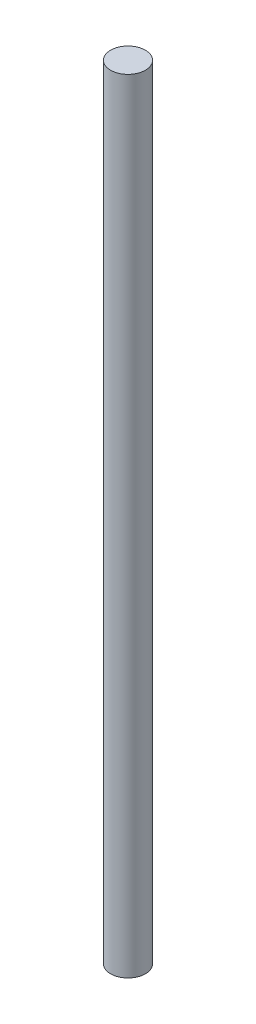
ISO-10303-21;
HEADER;
FILE_DESCRIPTION(('STEP AP214'),'2;1');
FILE_NAME('part.step','',(''),(''),'','','');
FILE_SCHEMA(('AUTOMOTIVE_DESIGN { 1 0 10303 214 1 1 1 1 }'));
ENDSEC;
DATA;
#1=APPLICATION_CONTEXT('core data for automotive mechanical design processes');
#2=APPLICATION_PROTOCOL_DEFINITION('international standard','automotive_design',2000,#1);
#3=PRODUCT_CONTEXT('',#1,'mechanical');
#4=PRODUCT('Part','Part','',(#3));
#5=PRODUCT_RELATED_PRODUCT_CATEGORY('part','',(#4));
#6=PRODUCT_DEFINITION_FORMATION('','',#4);
#7=PRODUCT_DEFINITION_CONTEXT('part definition',#1,'design');
#8=PRODUCT_DEFINITION('design','',#6,#7);
#9=PRODUCT_DEFINITION_SHAPE('','',#8);
#10=(LENGTH_UNIT() NAMED_UNIT(*) SI_UNIT(.MILLI.,.METRE.));
#11=(NAMED_UNIT(*) PLANE_ANGLE_UNIT() SI_UNIT($,.RADIAN.));
#12=(NAMED_UNIT(*) SI_UNIT($,.STERADIAN.) SOLID_ANGLE_UNIT());
#13=UNCERTAINTY_MEASURE_WITH_UNIT(LENGTH_MEASURE(1.E-05),#10,'distance_accuracy_value','');
#14=(GEOMETRIC_REPRESENTATION_CONTEXT(3) GLOBAL_UNCERTAINTY_ASSIGNED_CONTEXT((#13)) GLOBAL_UNIT_ASSIGNED_CONTEXT((#10,
#11,#12)) REPRESENTATION_CONTEXT('',''));
#15=CARTESIAN_POINT('',(0.,0.,0.));
#16=DIRECTION('',(0.,0.,1.));
#17=DIRECTION('',(1.,0.,0.));
#18=AXIS2_PLACEMENT_3D('',#15,#16,#17);
#19=CARTESIAN_POINT('',(0.,180.,0.));
#20=DIRECTION('',(0.,-1.,0.));
#21=DIRECTION('',(0.,0.,-1.));
#22=AXIS2_PLACEMENT_3D('',#19,#20,#21);
#23=CYLINDRICAL_SURFACE('',#22,4.);
#24=CARTESIAN_POINT('',(0.,180.,0.));
#25=DIRECTION('',(0.,1.,0.));
#26=DIRECTION('',(0.,0.,1.));
#27=AXIS2_PLACEMENT_3D('',#24,#25,#26);
#28=CIRCLE('',#27,4.);
#29=CARTESIAN_POINT('',(0.,180.,4.));
#30=VERTEX_POINT('',#29);
#31=EDGE_CURVE('E12',#30,#30,#28,.T.);
#32=ORIENTED_EDGE('',*,*,#31,.F.);
#33=EDGE_LOOP('',(#32));
#34=FACE_BOUND('',#33,.T.);
#35=CARTESIAN_POINT('',(0.,0.,0.));
#36=DIRECTION('',(0.,1.,0.));
#37=DIRECTION('',(0.,0.,1.));
#38=AXIS2_PLACEMENT_3D('',#35,#36,#37);
#39=CIRCLE('',#38,4.);
#40=CARTESIAN_POINT('',(0.,0.,4.));
#41=VERTEX_POINT('',#40);
#42=EDGE_CURVE('E46',#41,#41,#39,.T.);
#43=ORIENTED_EDGE('',*,*,#42,.T.);
#44=EDGE_LOOP('',(#43));
#45=FACE_BOUND('',#44,.T.);
#46=ADVANCED_FACE('F43',(#34,#45),#23,.T.);
#47=CARTESIAN_POINT('',(0.,180.,0.));
#48=DIRECTION('',(0.,1.,0.));
#49=DIRECTION('',(0.,0.,1.));
#50=AXIS2_PLACEMENT_3D('',#47,#48,#49);
#51=PLANE('',#50);
#52=ORIENTED_EDGE('',*,*,#31,.T.);
#53=EDGE_LOOP('',(#52));
#54=FACE_BOUND('',#53,.T.);
#55=ADVANCED_FACE('F58',(#54),#51,.T.);
#56=CARTESIAN_POINT('',(0.,0.,0.));
#57=DIRECTION('',(0.,1.,0.));
#58=DIRECTION('',(0.,0.,1.));
#59=AXIS2_PLACEMENT_3D('',#56,#57,#58);
#60=PLANE('',#59);
#61=ORIENTED_EDGE('',*,*,#42,.F.);
#62=EDGE_LOOP('',(#61));
#63=FACE_BOUND('',#62,.T.);
#64=ADVANCED_FACE('F56',(#63),#60,.F.);
#65=CLOSED_SHELL('',(#46,#55,#64));
#66=MANIFOLD_SOLID_BREP('B2',#65);
#67=ADVANCED_BREP_SHAPE_REPRESENTATION('',(#18,#66),#14);
#68=SHAPE_DEFINITION_REPRESENTATION(#9,#67);
ENDSEC;
END-ISO-10303-21;
